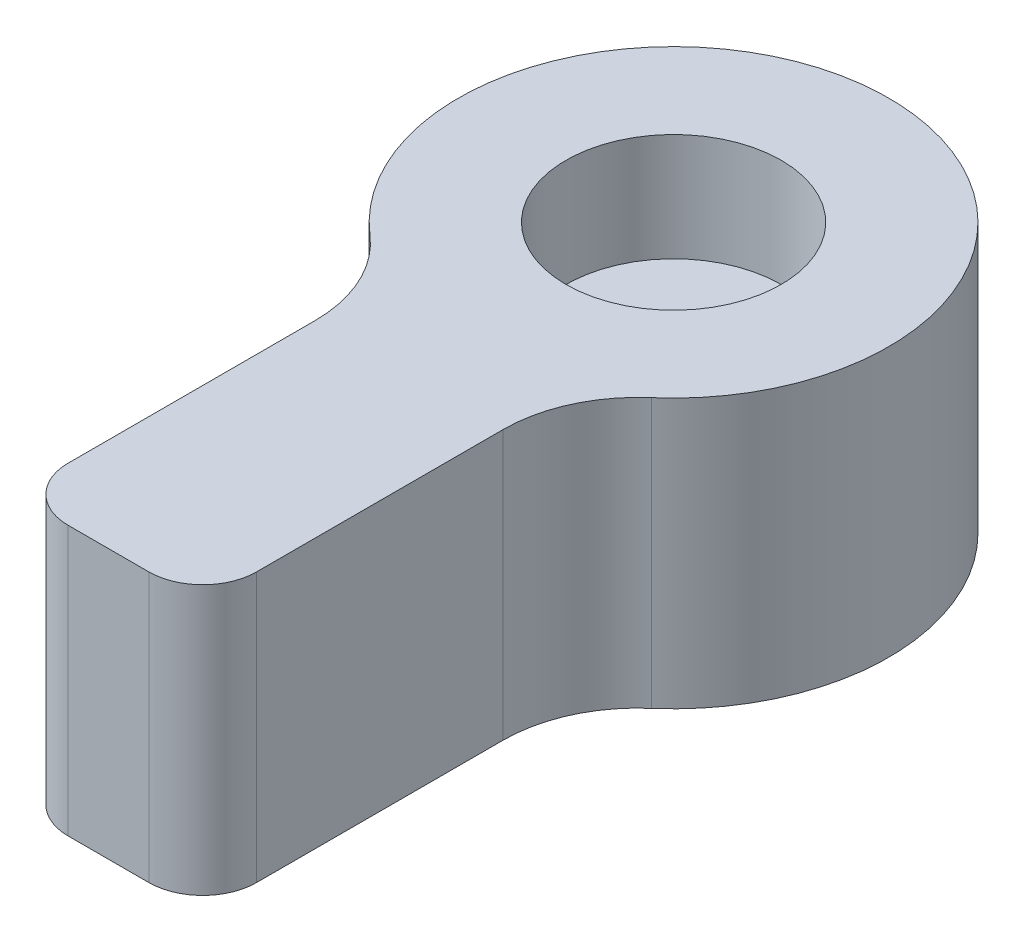
ISO-10303-21;
HEADER;
FILE_DESCRIPTION(('STEP AP214'),'2;1');
FILE_NAME('part.step','',(''),(''),'','','');
FILE_SCHEMA(('AUTOMOTIVE_DESIGN { 1 0 10303 214 1 1 1 1 }'));
ENDSEC;
DATA;
#1=APPLICATION_CONTEXT('core data for automotive mechanical design processes');
#2=APPLICATION_PROTOCOL_DEFINITION('international standard','automotive_design',2000,#1);
#3=PRODUCT_CONTEXT('',#1,'mechanical');
#4=PRODUCT('Part','Part','',(#3));
#5=PRODUCT_RELATED_PRODUCT_CATEGORY('part','',(#4));
#6=PRODUCT_DEFINITION_FORMATION('','',#4);
#7=PRODUCT_DEFINITION_CONTEXT('part definition',#1,'design');
#8=PRODUCT_DEFINITION('design','',#6,#7);
#9=PRODUCT_DEFINITION_SHAPE('','',#8);
#10=(LENGTH_UNIT() NAMED_UNIT(*) SI_UNIT(.MILLI.,.METRE.));
#11=(NAMED_UNIT(*) PLANE_ANGLE_UNIT() SI_UNIT($,.RADIAN.));
#12=(NAMED_UNIT(*) SI_UNIT($,.STERADIAN.) SOLID_ANGLE_UNIT());
#13=UNCERTAINTY_MEASURE_WITH_UNIT(LENGTH_MEASURE(1.E-05),#10,'distance_accuracy_value','');
#14=(GEOMETRIC_REPRESENTATION_CONTEXT(3) GLOBAL_UNCERTAINTY_ASSIGNED_CONTEXT((#13)) GLOBAL_UNIT_ASSIGNED_CONTEXT((#10,
#11,#12)) REPRESENTATION_CONTEXT('',''));
#15=CARTESIAN_POINT('',(0.,0.,0.));
#16=DIRECTION('',(0.,0.,1.));
#17=DIRECTION('',(1.,0.,0.));
#18=AXIS2_PLACEMENT_3D('',#15,#16,#17);
#19=CARTESIAN_POINT('',(3.5,10.,7.19374728496908));
#20=DIRECTION('',(-1.,0.,0.));
#21=DIRECTION('',(0.,0.,1.));
#22=AXIS2_PLACEMENT_3D('',#19,#20,#21);
#23=PLANE('',#22);
#24=DIRECTION('',(0.,0.,-1.));
#25=VECTOR('',#24,1.);
#26=CARTESIAN_POINT('',(3.5,0.,7.19374728496908));
#27=LINE('',#26,#25);
#28=CARTESIAN_POINT('',(3.50000000000001,0.,19.));
#29=VERTEX_POINT('',#28);
#30=CARTESIAN_POINT('',(3.50000000000001,0.,9.836157786453));
#31=VERTEX_POINT('',#30);
#32=EDGE_CURVE('E116',#29,#31,#27,.T.);
#33=ORIENTED_EDGE('',*,*,#32,.T.);
#34=DIRECTION('',(0.,1.,0.));
#35=VECTOR('',#34,1.);
#36=CARTESIAN_POINT('',(3.50000000000001,10.,9.836157786453));
#37=LINE('',#36,#35);
#38=CARTESIAN_POINT('',(3.50000000000001,10.,9.836157786453));
#39=VERTEX_POINT('',#38);
#40=EDGE_CURVE('E157',#31,#39,#37,.T.);
#41=ORIENTED_EDGE('',*,*,#40,.T.);
#42=DIRECTION('',(0.,0.,-1.));
#43=VECTOR('',#42,1.);
#44=CARTESIAN_POINT('',(3.5,10.,7.19374728496908));
#45=LINE('',#44,#43);
#46=CARTESIAN_POINT('',(3.50000000000001,10.,19.));
#47=VERTEX_POINT('',#46);
#48=EDGE_CURVE('E119',#47,#39,#45,.T.);
#49=ORIENTED_EDGE('',*,*,#48,.F.);
#50=DIRECTION('',(0.,-1.,0.));
#51=VECTOR('',#50,1.);
#52=CARTESIAN_POINT('',(3.50000000000001,10.,19.));
#53=LINE('',#52,#51);
#54=EDGE_CURVE('E104',#47,#29,#53,.T.);
#55=ORIENTED_EDGE('',*,*,#54,.T.);
#56=EDGE_LOOP('',(#33,#41,#49,#55));
#57=FACE_BOUND('',#56,.T.);
#58=ADVANCED_FACE('F36',(#57),#23,.F.);
#59=CARTESIAN_POINT('',(0.,10.,0.));
#60=DIRECTION('',(0.,-1.,0.));
#61=DIRECTION('',(0.,0.,-1.));
#62=AXIS2_PLACEMENT_3D('',#59,#60,#61);
#63=CYLINDRICAL_SURFACE('',#62,8.);
#64=CARTESIAN_POINT('',(0.,10.,0.));
#65=DIRECTION('',(0.,1.,0.));
#66=DIRECTION('',(0.,0.,1.));
#67=AXIS2_PLACEMENT_3D('',#64,#65,#66);
#68=CIRCLE('',#67,8.);
#69=CARTESIAN_POINT('',(5.23076923076923,10.,6.05302017627876));
#70=VERTEX_POINT('',#69);
#71=CARTESIAN_POINT('',(-5.23076923076923,10.,6.05302017627877));
#72=VERTEX_POINT('',#71);
#73=EDGE_CURVE('E173',#70,#72,#68,.T.);
#74=ORIENTED_EDGE('',*,*,#73,.F.);
#75=DIRECTION('',(0.,-1.,0.));
#76=VECTOR('',#75,1.);
#77=CARTESIAN_POINT('',(5.23076923076923,10.,6.05302017627876));
#78=LINE('',#77,#76);
#79=CARTESIAN_POINT('',(5.23076923076923,0.,6.05302017627876));
#80=VERTEX_POINT('',#79);
#81=EDGE_CURVE('E154',#70,#80,#78,.T.);
#82=ORIENTED_EDGE('',*,*,#81,.T.);
#83=CARTESIAN_POINT('',(0.,0.,0.));
#84=DIRECTION('',(0.,1.,0.));
#85=DIRECTION('',(0.,0.,1.));
#86=AXIS2_PLACEMENT_3D('',#83,#84,#85);
#87=CIRCLE('',#86,8.);
#88=CARTESIAN_POINT('',(-5.23076923076923,0.,6.05302017627877));
#89=VERTEX_POINT('',#88);
#90=EDGE_CURVE('E125',#80,#89,#87,.T.);
#91=ORIENTED_EDGE('',*,*,#90,.T.);
#92=DIRECTION('',(0.,-1.,0.));
#93=VECTOR('',#92,1.);
#94=CARTESIAN_POINT('',(-5.23076923076923,10.,6.05302017627877));
#95=LINE('',#94,#93);
#96=EDGE_CURVE('E152',#89,#72,#95,.F.);
#97=ORIENTED_EDGE('',*,*,#96,.T.);
#98=EDGE_LOOP('',(#74,#82,#91,#97));
#99=FACE_BOUND('',#98,.T.);
#100=ADVANCED_FACE('F166',(#99),#63,.T.);
#101=CARTESIAN_POINT('',(-3.49999999999999,10.,7.19374728496908));
#102=DIRECTION('',(1.,0.,0.));
#103=DIRECTION('',(0.,0.,-1.));
#104=AXIS2_PLACEMENT_3D('',#101,#102,#103);
#105=PLANE('',#104);
#106=DIRECTION('',(0.,0.,1.));
#107=VECTOR('',#106,1.);
#108=CARTESIAN_POINT('',(-3.49999999999999,10.,7.19374728496908));
#109=LINE('',#108,#107);
#110=CARTESIAN_POINT('',(-3.49999999999999,10.,9.836157786453));
#111=VERTEX_POINT('',#110);
#112=CARTESIAN_POINT('',(-3.49999999999999,10.,19.));
#113=VERTEX_POINT('',#112);
#114=EDGE_CURVE('E170',#111,#113,#109,.T.);
#115=ORIENTED_EDGE('',*,*,#114,.F.);
#116=DIRECTION('',(0.,1.,0.));
#117=VECTOR('',#116,1.);
#118=CARTESIAN_POINT('',(-3.49999999999999,0.,9.836157786453));
#119=LINE('',#118,#117);
#120=CARTESIAN_POINT('',(-3.49999999999999,0.,9.836157786453));
#121=VERTEX_POINT('',#120);
#122=EDGE_CURVE('E159',#111,#121,#119,.F.);
#123=ORIENTED_EDGE('',*,*,#122,.T.);
#124=DIRECTION('',(0.,0.,1.));
#125=VECTOR('',#124,1.);
#126=CARTESIAN_POINT('',(-3.49999999999999,0.,7.19374728496908));
#127=LINE('',#126,#125);
#128=CARTESIAN_POINT('',(-3.49999999999999,0.,19.));
#129=VERTEX_POINT('',#128);
#130=EDGE_CURVE('E129',#121,#129,#127,.T.);
#131=ORIENTED_EDGE('',*,*,#130,.T.);
#132=DIRECTION('',(0.,-1.,0.));
#133=VECTOR('',#132,1.);
#134=CARTESIAN_POINT('',(-3.49999999999999,10.,19.));
#135=LINE('',#134,#133);
#136=EDGE_CURVE('E149',#129,#113,#135,.F.);
#137=ORIENTED_EDGE('',*,*,#136,.T.);
#138=EDGE_LOOP('',(#115,#123,#131,#137));
#139=FACE_BOUND('',#138,.T.);
#140=ADVANCED_FACE('F169',(#139),#105,.F.);
#141=CARTESIAN_POINT('',(-3.49999999999999,10.,21.));
#142=DIRECTION('',(0.,0.,-1.));
#143=DIRECTION('',(-1.,0.,0.));
#144=AXIS2_PLACEMENT_3D('',#141,#142,#143);
#145=PLANE('',#144);
#146=DIRECTION('',(1.,0.,0.));
#147=VECTOR('',#146,1.);
#148=CARTESIAN_POINT('',(-3.49999999999999,0.,21.));
#149=LINE('',#148,#147);
#150=CARTESIAN_POINT('',(-1.49999999999999,0.,21.));
#151=VERTEX_POINT('',#150);
#152=CARTESIAN_POINT('',(1.50000000000001,0.,21.));
#153=VERTEX_POINT('',#152);
#154=EDGE_CURVE('E138',#151,#153,#149,.T.);
#155=ORIENTED_EDGE('',*,*,#154,.T.);
#156=DIRECTION('',(0.,-1.,0.));
#157=VECTOR('',#156,1.);
#158=CARTESIAN_POINT('',(1.50000000000001,10.,21.));
#159=LINE('',#158,#157);
#160=CARTESIAN_POINT('',(1.50000000000001,10.,21.));
#161=VERTEX_POINT('',#160);
#162=EDGE_CURVE('E105',#153,#161,#159,.F.);
#163=ORIENTED_EDGE('',*,*,#162,.T.);
#164=DIRECTION('',(1.,0.,0.));
#165=VECTOR('',#164,1.);
#166=CARTESIAN_POINT('',(-3.49999999999999,10.,21.));
#167=LINE('',#166,#165);
#168=CARTESIAN_POINT('',(-1.49999999999999,10.,21.));
#169=VERTEX_POINT('',#168);
#170=EDGE_CURVE('E120',#169,#161,#167,.T.);
#171=ORIENTED_EDGE('',*,*,#170,.F.);
#172=DIRECTION('',(0.,-1.,0.));
#173=VECTOR('',#172,1.);
#174=CARTESIAN_POINT('',(-1.49999999999999,10.,21.));
#175=LINE('',#174,#173);
#176=EDGE_CURVE('E110',#169,#151,#175,.T.);
#177=ORIENTED_EDGE('',*,*,#176,.T.);
#178=EDGE_LOOP('',(#155,#163,#171,#177));
#179=FACE_BOUND('',#178,.T.);
#180=ADVANCED_FACE('F203',(#179),#145,.F.);
#181=CARTESIAN_POINT('',(0.,10.,0.));
#182=DIRECTION('',(0.,1.,0.));
#183=DIRECTION('',(0.,0.,1.));
#184=AXIS2_PLACEMENT_3D('',#181,#182,#183);
#185=PLANE('',#184);
#186=CARTESIAN_POINT('',(0.,10.,0.));
#187=DIRECTION('',(0.,1.,0.));
#188=DIRECTION('',(0.,0.,1.));
#189=AXIS2_PLACEMENT_3D('',#186,#187,#188);
#190=CIRCLE('',#189,4.);
#191=CARTESIAN_POINT('',(0.,10.,4.));
#192=VERTEX_POINT('',#191);
#193=EDGE_CURVE('E132',#192,#192,#190,.T.);
#194=ORIENTED_EDGE('',*,*,#193,.F.);
#195=EDGE_LOOP('',(#194));
#196=FACE_BOUND('',#195,.T.);
#197=ORIENTED_EDGE('',*,*,#170,.T.);
#198=CARTESIAN_POINT('',(1.50000000000001,10.,19.));
#199=DIRECTION('',(0.,1.,0.));
#200=DIRECTION('',(0.,0.,1.));
#201=AXIS2_PLACEMENT_3D('',#198,#199,#200);
#202=CIRCLE('',#201,2.);
#203=EDGE_CURVE('E147',#161,#47,#202,.T.);
#204=ORIENTED_EDGE('',*,*,#203,.T.);
#205=ORIENTED_EDGE('',*,*,#48,.T.);
#206=CARTESIAN_POINT('',(8.50000000000001,10.,9.83615778645299));
#207=DIRECTION('',(0.,1.,0.));
#208=DIRECTION('',(0.,0.,1.));
#209=AXIS2_PLACEMENT_3D('',#206,#207,#208);
#210=CIRCLE('',#209,5.);
#211=EDGE_CURVE('E162',#39,#70,#210,.F.);
#212=ORIENTED_EDGE('',*,*,#211,.T.);
#213=ORIENTED_EDGE('',*,*,#73,.T.);
#214=CARTESIAN_POINT('',(-8.49999999999999,10.,9.836157786453));
#215=DIRECTION('',(0.,1.,0.));
#216=DIRECTION('',(0.,0.,1.));
#217=AXIS2_PLACEMENT_3D('',#214,#215,#216);
#218=CIRCLE('',#217,5.);
#219=EDGE_CURVE('E11',#72,#111,#218,.F.);
#220=ORIENTED_EDGE('',*,*,#219,.T.);
#221=ORIENTED_EDGE('',*,*,#114,.T.);
#222=CARTESIAN_POINT('',(-1.49999999999999,10.,19.));
#223=DIRECTION('',(0.,1.,0.));
#224=DIRECTION('',(0.,0.,1.));
#225=AXIS2_PLACEMENT_3D('',#222,#223,#224);
#226=CIRCLE('',#225,2.);
#227=EDGE_CURVE('E145',#113,#169,#226,.T.);
#228=ORIENTED_EDGE('',*,*,#227,.T.);
#229=EDGE_LOOP('',(#197,#204,#205,#212,#213,#220,#221,#228));
#230=FACE_BOUND('',#229,.T.);
#231=ADVANCED_FACE('F201',(#196,#230),#185,.T.);
#232=CARTESIAN_POINT('',(0.,0.,0.));
#233=DIRECTION('',(0.,1.,0.));
#234=DIRECTION('',(0.,0.,1.));
#235=AXIS2_PLACEMENT_3D('',#232,#233,#234);
#236=PLANE('',#235);
#237=CARTESIAN_POINT('',(0.,0.,0.));
#238=DIRECTION('',(0.,1.,0.));
#239=DIRECTION('',(0.,0.,1.));
#240=AXIS2_PLACEMENT_3D('',#237,#238,#239);
#241=CIRCLE('',#240,1.65);
#242=CARTESIAN_POINT('',(0.,0.,1.65));
#243=VERTEX_POINT('',#242);
#244=EDGE_CURVE('E179',#243,#243,#241,.T.);
#245=ORIENTED_EDGE('',*,*,#244,.T.);
#246=EDGE_LOOP('',(#245));
#247=FACE_BOUND('',#246,.T.);
#248=ORIENTED_EDGE('',*,*,#32,.F.);
#249=CARTESIAN_POINT('',(1.50000000000001,0.,19.));
#250=DIRECTION('',(0.,1.,0.));
#251=DIRECTION('',(0.,0.,1.));
#252=AXIS2_PLACEMENT_3D('',#249,#250,#251);
#253=CIRCLE('',#252,2.);
#254=EDGE_CURVE('E100',#29,#153,#253,.F.);
#255=ORIENTED_EDGE('',*,*,#254,.T.);
#256=ORIENTED_EDGE('',*,*,#154,.F.);
#257=CARTESIAN_POINT('',(-1.49999999999999,0.,19.));
#258=DIRECTION('',(0.,1.,0.));
#259=DIRECTION('',(0.,0.,1.));
#260=AXIS2_PLACEMENT_3D('',#257,#258,#259);
#261=CIRCLE('',#260,2.);
#262=EDGE_CURVE('E111',#151,#129,#261,.F.);
#263=ORIENTED_EDGE('',*,*,#262,.T.);
#264=ORIENTED_EDGE('',*,*,#130,.F.);
#265=CARTESIAN_POINT('',(-8.49999999999999,0.,9.836157786453));
#266=DIRECTION('',(0.,1.,0.));
#267=DIRECTION('',(0.,0.,1.));
#268=AXIS2_PLACEMENT_3D('',#265,#266,#267);
#269=CIRCLE('',#268,5.);
#270=EDGE_CURVE('E44',#121,#89,#269,.T.);
#271=ORIENTED_EDGE('',*,*,#270,.T.);
#272=ORIENTED_EDGE('',*,*,#90,.F.);
#273=CARTESIAN_POINT('',(8.50000000000001,0.,9.83615778645299));
#274=DIRECTION('',(0.,1.,0.));
#275=DIRECTION('',(0.,0.,1.));
#276=AXIS2_PLACEMENT_3D('',#273,#274,#275);
#277=CIRCLE('',#276,5.);
#278=EDGE_CURVE('E124',#80,#31,#277,.T.);
#279=ORIENTED_EDGE('',*,*,#278,.T.);
#280=EDGE_LOOP('',(#248,#255,#256,#263,#264,#271,#272,#279));
#281=FACE_BOUND('',#280,.T.);
#282=ADVANCED_FACE('F122',(#247,#281),#236,.F.);
#283=CARTESIAN_POINT('',(1.50000000000001,10.,19.));
#284=DIRECTION('',(0.,-1.,0.));
#285=DIRECTION('',(0.,0.,-1.));
#286=AXIS2_PLACEMENT_3D('',#283,#284,#285);
#287=CYLINDRICAL_SURFACE('',#286,2.);
#288=ORIENTED_EDGE('',*,*,#203,.F.);
#289=ORIENTED_EDGE('',*,*,#162,.F.);
#290=ORIENTED_EDGE('',*,*,#254,.F.);
#291=ORIENTED_EDGE('',*,*,#54,.F.);
#292=EDGE_LOOP('',(#288,#289,#290,#291));
#293=FACE_BOUND('',#292,.T.);
#294=ADVANCED_FACE('F103',(#293),#287,.T.);
#295=CARTESIAN_POINT('',(-1.49999999999999,10.,19.));
#296=DIRECTION('',(0.,-1.,0.));
#297=DIRECTION('',(0.,0.,-1.));
#298=AXIS2_PLACEMENT_3D('',#295,#296,#297);
#299=CYLINDRICAL_SURFACE('',#298,2.);
#300=ORIENTED_EDGE('',*,*,#227,.F.);
#301=ORIENTED_EDGE('',*,*,#136,.F.);
#302=ORIENTED_EDGE('',*,*,#262,.F.);
#303=ORIENTED_EDGE('',*,*,#176,.F.);
#304=EDGE_LOOP('',(#300,#301,#302,#303));
#305=FACE_BOUND('',#304,.T.);
#306=ADVANCED_FACE('F209',(#305),#299,.T.);
#307=CARTESIAN_POINT('',(8.50000000000001,10.,9.83615778645299));
#308=DIRECTION('',(0.,-1.,0.));
#309=DIRECTION('',(0.,0.,-1.));
#310=AXIS2_PLACEMENT_3D('',#307,#308,#309);
#311=CYLINDRICAL_SURFACE('',#310,5.);
#312=ORIENTED_EDGE('',*,*,#211,.F.);
#313=ORIENTED_EDGE('',*,*,#40,.F.);
#314=ORIENTED_EDGE('',*,*,#278,.F.);
#315=ORIENTED_EDGE('',*,*,#81,.F.);
#316=EDGE_LOOP('',(#312,#313,#314,#315));
#317=FACE_BOUND('',#316,.T.);
#318=ADVANCED_FACE('F211',(#317),#311,.F.);
#319=CARTESIAN_POINT('',(-8.49999999999999,10.,9.836157786453));
#320=DIRECTION('',(0.,-1.,0.));
#321=DIRECTION('',(0.,0.,-1.));
#322=AXIS2_PLACEMENT_3D('',#319,#320,#321);
#323=CYLINDRICAL_SURFACE('',#322,5.);
#324=ORIENTED_EDGE('',*,*,#219,.F.);
#325=ORIENTED_EDGE('',*,*,#96,.F.);
#326=ORIENTED_EDGE('',*,*,#270,.F.);
#327=ORIENTED_EDGE('',*,*,#122,.F.);
#328=EDGE_LOOP('',(#324,#325,#326,#327));
#329=FACE_BOUND('',#328,.T.);
#330=ADVANCED_FACE('F38',(#329),#323,.F.);
#331=CARTESIAN_POINT('',(0.,6.,0.));
#332=DIRECTION('',(0.,1.,0.));
#333=DIRECTION('',(0.,0.,1.));
#334=AXIS2_PLACEMENT_3D('',#331,#332,#333);
#335=CYLINDRICAL_SURFACE('',#334,4.);
#336=CARTESIAN_POINT('',(0.,6.,0.));
#337=DIRECTION('',(0.,1.,0.));
#338=DIRECTION('',(0.,0.,1.));
#339=AXIS2_PLACEMENT_3D('',#336,#337,#338);
#340=CIRCLE('',#339,4.);
#341=CARTESIAN_POINT('',(0.,6.,4.));
#342=VERTEX_POINT('',#341);
#343=EDGE_CURVE('E126',#342,#342,#340,.T.);
#344=ORIENTED_EDGE('',*,*,#343,.F.);
#345=EDGE_LOOP('',(#344));
#346=FACE_BOUND('',#345,.T.);
#347=ORIENTED_EDGE('',*,*,#193,.T.);
#348=EDGE_LOOP('',(#347));
#349=FACE_BOUND('',#348,.T.);
#350=ADVANCED_FACE('F192',(#346,#349),#335,.F.);
#351=CARTESIAN_POINT('',(0.,6.,0.));
#352=DIRECTION('',(0.,1.,0.));
#353=DIRECTION('',(0.,0.,1.));
#354=AXIS2_PLACEMENT_3D('',#351,#352,#353);
#355=PLANE('',#354);
#356=CARTESIAN_POINT('',(0.,6.,0.));
#357=DIRECTION('',(0.,1.,0.));
#358=DIRECTION('',(0.,0.,1.));
#359=AXIS2_PLACEMENT_3D('',#356,#357,#358);
#360=CIRCLE('',#359,1.64999999999999);
#361=CARTESIAN_POINT('',(0.,6.,1.64999999999999));
#362=VERTEX_POINT('',#361);
#363=EDGE_CURVE('E183',#362,#362,#360,.T.);
#364=ORIENTED_EDGE('',*,*,#363,.F.);
#365=EDGE_LOOP('',(#364));
#366=FACE_BOUND('',#365,.T.);
#367=ORIENTED_EDGE('',*,*,#343,.T.);
#368=EDGE_LOOP('',(#367));
#369=FACE_BOUND('',#368,.T.);
#370=ADVANCED_FACE('F189',(#366,#369),#355,.T.);
#371=CARTESIAN_POINT('',(0.,6.,0.));
#372=DIRECTION('',(0.,1.,0.));
#373=DIRECTION('',(0.,0.,1.));
#374=AXIS2_PLACEMENT_3D('',#371,#372,#373);
#375=CYLINDRICAL_SURFACE('',#374,1.64999999999999);
#376=ORIENTED_EDGE('',*,*,#244,.F.);
#377=EDGE_LOOP('',(#376));
#378=FACE_BOUND('',#377,.T.);
#379=ORIENTED_EDGE('',*,*,#363,.T.);
#380=EDGE_LOOP('',(#379));
#381=FACE_BOUND('',#380,.T.);
#382=ADVANCED_FACE('F187',(#378,#381),#375,.F.);
#383=CLOSED_SHELL('',(#58,#100,#140,#180,#231,#282,#294,#306,#318,#330,#350,#370,#382));
#384=MANIFOLD_SOLID_BREP('B2',#383);
#385=ADVANCED_BREP_SHAPE_REPRESENTATION('',(#18,#384),#14);
#386=SHAPE_DEFINITION_REPRESENTATION(#9,#385);
ENDSEC;
END-ISO-10303-21;
